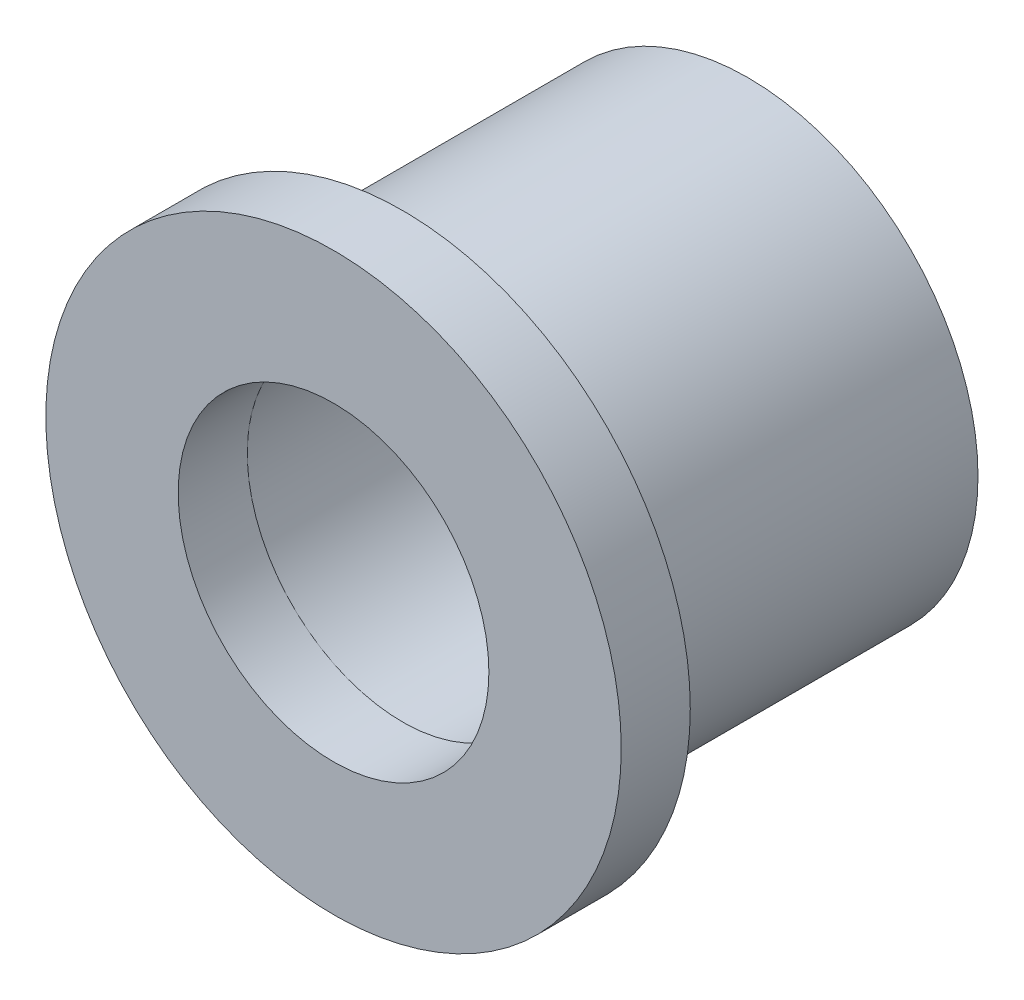
ISO-10303-21;
HEADER;
FILE_DESCRIPTION(('STEP AP214'),'2;1');
FILE_NAME('part.step','',(''),(''),'','','');
FILE_SCHEMA(('AUTOMOTIVE_DESIGN { 1 0 10303 214 1 1 1 1 }'));
ENDSEC;
DATA;
#1=APPLICATION_CONTEXT('core data for automotive mechanical design processes');
#2=APPLICATION_PROTOCOL_DEFINITION('international standard','automotive_design',2000,#1);
#3=PRODUCT_CONTEXT('',#1,'mechanical');
#4=PRODUCT('Part','Part','',(#3));
#5=PRODUCT_RELATED_PRODUCT_CATEGORY('part','',(#4));
#6=PRODUCT_DEFINITION_FORMATION('','',#4);
#7=PRODUCT_DEFINITION_CONTEXT('part definition',#1,'design');
#8=PRODUCT_DEFINITION('design','',#6,#7);
#9=PRODUCT_DEFINITION_SHAPE('','',#8);
#10=(LENGTH_UNIT() NAMED_UNIT(*) SI_UNIT(.MILLI.,.METRE.));
#11=(NAMED_UNIT(*) PLANE_ANGLE_UNIT() SI_UNIT($,.RADIAN.));
#12=(NAMED_UNIT(*) SI_UNIT($,.STERADIAN.) SOLID_ANGLE_UNIT());
#13=UNCERTAINTY_MEASURE_WITH_UNIT(LENGTH_MEASURE(1.E-05),#10,'distance_accuracy_value','');
#14=(GEOMETRIC_REPRESENTATION_CONTEXT(3) GLOBAL_UNCERTAINTY_ASSIGNED_CONTEXT((#13)) GLOBAL_UNIT_ASSIGNED_CONTEXT((#10,
#11,#12)) REPRESENTATION_CONTEXT('',''));
#15=CARTESIAN_POINT('',(0.,0.,0.));
#16=DIRECTION('',(0.,0.,1.));
#17=DIRECTION('',(1.,0.,0.));
#18=AXIS2_PLACEMENT_3D('',#15,#16,#17);
#19=CARTESIAN_POINT('',(0.,0.,0.));
#20=DIRECTION('',(0.,0.,1.));
#21=DIRECTION('',(1.,0.,0.));
#22=AXIS2_PLACEMENT_3D('',#19,#20,#21);
#23=PLANE('',#22);
#24=CARTESIAN_POINT('',(0.,0.,0.));
#25=DIRECTION('',(0.,0.,1.));
#26=DIRECTION('',(1.,0.,0.));
#27=AXIS2_PLACEMENT_3D('',#24,#25,#26);
#28=CIRCLE('',#27,8.5725);
#29=CARTESIAN_POINT('',(8.5725,0.,0.));
#30=VERTEX_POINT('',#29);
#31=EDGE_CURVE('E58',#30,#30,#28,.T.);
#32=ORIENTED_EDGE('',*,*,#31,.T.);
#33=EDGE_LOOP('',(#32));
#34=FACE_BOUND('',#33,.T.);
#35=CARTESIAN_POINT('',(0.,0.,0.));
#36=DIRECTION('',(0.,0.,-1.));
#37=DIRECTION('',(-1.,0.,0.));
#38=AXIS2_PLACEMENT_3D('',#35,#36,#37);
#39=CIRCLE('',#38,8.636);
#40=CARTESIAN_POINT('',(-8.636,0.,0.));
#41=VERTEX_POINT('',#40);
#42=EDGE_CURVE('E70',#41,#41,#39,.T.);
#43=ORIENTED_EDGE('',*,*,#42,.T.);
#44=EDGE_LOOP('',(#43));
#45=FACE_BOUND('',#44,.T.);
#46=ADVANCED_FACE('F37',(#34,#45),#23,.F.);
#47=CARTESIAN_POINT('',(0.,0.,3.81));
#48=DIRECTION('',(0.,0.,1.));
#49=DIRECTION('',(1.,0.,0.));
#50=AXIS2_PLACEMENT_3D('',#47,#48,#49);
#51=PLANE('',#50);
#52=CARTESIAN_POINT('',(0.,0.,3.81));
#53=DIRECTION('',(0.,0.,1.));
#54=DIRECTION('',(1.,0.,0.));
#55=AXIS2_PLACEMENT_3D('',#52,#53,#54);
#56=CIRCLE('',#55,15.875);
#57=CARTESIAN_POINT('',(15.875,0.,3.81));
#58=VERTEX_POINT('',#57);
#59=EDGE_CURVE('E45',#58,#58,#56,.T.);
#60=ORIENTED_EDGE('',*,*,#59,.T.);
#61=EDGE_LOOP('',(#60));
#62=FACE_BOUND('',#61,.T.);
#63=CARTESIAN_POINT('',(0.,0.,3.81));
#64=DIRECTION('',(0.,0.,1.));
#65=DIRECTION('',(1.,0.,0.));
#66=AXIS2_PLACEMENT_3D('',#63,#64,#65);
#67=CIRCLE('',#66,8.5725);
#68=CARTESIAN_POINT('',(8.5725,0.,3.81));
#69=VERTEX_POINT('',#68);
#70=EDGE_CURVE('E56',#69,#69,#67,.T.);
#71=ORIENTED_EDGE('',*,*,#70,.F.);
#72=EDGE_LOOP('',(#71));
#73=FACE_BOUND('',#72,.T.);
#74=ADVANCED_FACE('F97',(#62,#73),#51,.T.);
#75=CARTESIAN_POINT('',(0.,0.,0.));
#76=DIRECTION('',(0.,0.,1.));
#77=DIRECTION('',(1.,0.,0.));
#78=AXIS2_PLACEMENT_3D('',#75,#76,#77);
#79=CIRCLE('',#78,12.7);
#80=CARTESIAN_POINT('',(12.7,0.,0.));
#81=VERTEX_POINT('',#80);
#82=EDGE_CURVE('E10',#81,#81,#79,.F.);
#83=ORIENTED_EDGE('',*,*,#82,.F.);
#84=EDGE_LOOP('',(#83));
#85=FACE_BOUND('',#84,.T.);
#86=CARTESIAN_POINT('',(0.,0.,0.));
#87=DIRECTION('',(0.,0.,1.));
#88=DIRECTION('',(1.,0.,0.));
#89=AXIS2_PLACEMENT_3D('',#86,#87,#88);
#90=CIRCLE('',#89,15.875);
#91=CARTESIAN_POINT('',(15.875,0.,0.));
#92=VERTEX_POINT('',#91);
#93=EDGE_CURVE('E50',#92,#92,#90,.T.);
#94=ORIENTED_EDGE('',*,*,#93,.F.);
#95=EDGE_LOOP('',(#94));
#96=FACE_BOUND('',#95,.T.);
#97=ADVANCED_FACE('F99',(#85,#96),#23,.F.);
#98=CARTESIAN_POINT('',(0.,0.,3.81));
#99=DIRECTION('',(0.,0.,-1.));
#100=DIRECTION('',(-1.,0.,0.));
#101=AXIS2_PLACEMENT_3D('',#98,#99,#100);
#102=CYLINDRICAL_SURFACE('',#101,15.875);
#103=ORIENTED_EDGE('',*,*,#59,.F.);
#104=EDGE_LOOP('',(#103));
#105=FACE_BOUND('',#104,.T.);
#106=ORIENTED_EDGE('',*,*,#93,.T.);
#107=EDGE_LOOP('',(#106));
#108=FACE_BOUND('',#107,.T.);
#109=ADVANCED_FACE('F39',(#105,#108),#102,.T.);
#110=CARTESIAN_POINT('',(0.,0.,3.81));
#111=DIRECTION('',(0.,0.,-1.));
#112=DIRECTION('',(-1.,0.,0.));
#113=AXIS2_PLACEMENT_3D('',#110,#111,#112);
#114=CYLINDRICAL_SURFACE('',#113,8.5725);
#115=ORIENTED_EDGE('',*,*,#70,.T.);
#116=EDGE_LOOP('',(#115));
#117=FACE_BOUND('',#116,.T.);
#118=ORIENTED_EDGE('',*,*,#31,.F.);
#119=EDGE_LOOP('',(#118));
#120=FACE_BOUND('',#119,.T.);
#121=ADVANCED_FACE('F84',(#117,#120),#114,.F.);
#122=CARTESIAN_POINT('',(0.,0.,-19.05));
#123=DIRECTION('',(0.,0.,-1.));
#124=DIRECTION('',(-1.,0.,0.));
#125=AXIS2_PLACEMENT_3D('',#122,#123,#124);
#126=PLANE('',#125);
#127=CARTESIAN_POINT('',(0.,0.,-19.05));
#128=DIRECTION('',(0.,0.,-1.));
#129=DIRECTION('',(-1.,0.,0.));
#130=AXIS2_PLACEMENT_3D('',#127,#128,#129);
#131=CIRCLE('',#130,12.7);
#132=CARTESIAN_POINT('',(-12.7,0.,-19.05));
#133=VERTEX_POINT('',#132);
#134=EDGE_CURVE('E62',#133,#133,#131,.T.);
#135=ORIENTED_EDGE('',*,*,#134,.T.);
#136=EDGE_LOOP('',(#135));
#137=FACE_BOUND('',#136,.T.);
#138=CARTESIAN_POINT('',(0.,0.,-19.05));
#139=DIRECTION('',(0.,0.,-1.));
#140=DIRECTION('',(-1.,0.,0.));
#141=AXIS2_PLACEMENT_3D('',#138,#139,#140);
#142=CIRCLE('',#141,8.636);
#143=CARTESIAN_POINT('',(-8.636,0.,-19.05));
#144=VERTEX_POINT('',#143);
#145=EDGE_CURVE('E69',#144,#144,#142,.T.);
#146=ORIENTED_EDGE('',*,*,#145,.F.);
#147=EDGE_LOOP('',(#146));
#148=FACE_BOUND('',#147,.T.);
#149=ADVANCED_FACE('F81',(#137,#148),#126,.T.);
#150=CARTESIAN_POINT('',(0.,0.,-19.05));
#151=DIRECTION('',(0.,0.,1.));
#152=DIRECTION('',(1.,0.,0.));
#153=AXIS2_PLACEMENT_3D('',#150,#151,#152);
#154=CYLINDRICAL_SURFACE('',#153,12.7);
#155=ORIENTED_EDGE('',*,*,#134,.F.);
#156=EDGE_LOOP('',(#155));
#157=FACE_BOUND('',#156,.T.);
#158=ORIENTED_EDGE('',*,*,#82,.T.);
#159=EDGE_LOOP('',(#158));
#160=FACE_BOUND('',#159,.T.);
#161=ADVANCED_FACE('F83',(#157,#160),#154,.T.);
#162=CARTESIAN_POINT('',(0.,0.,-19.05));
#163=DIRECTION('',(0.,0.,1.));
#164=DIRECTION('',(1.,0.,0.));
#165=AXIS2_PLACEMENT_3D('',#162,#163,#164);
#166=CYLINDRICAL_SURFACE('',#165,8.636);
#167=ORIENTED_EDGE('',*,*,#145,.T.);
#168=EDGE_LOOP('',(#167));
#169=FACE_BOUND('',#168,.T.);
#170=ORIENTED_EDGE('',*,*,#42,.F.);
#171=EDGE_LOOP('',(#170));
#172=FACE_BOUND('',#171,.T.);
#173=ADVANCED_FACE('F78',(#169,#172),#166,.F.);
#174=CLOSED_SHELL('',(#46,#74,#97,#109,#121,#149,#161,#173));
#175=MANIFOLD_SOLID_BREP('B2',#174);
#176=ADVANCED_BREP_SHAPE_REPRESENTATION('',(#18,#175),#14);
#177=SHAPE_DEFINITION_REPRESENTATION(#9,#176);
ENDSEC;
END-ISO-10303-21;
